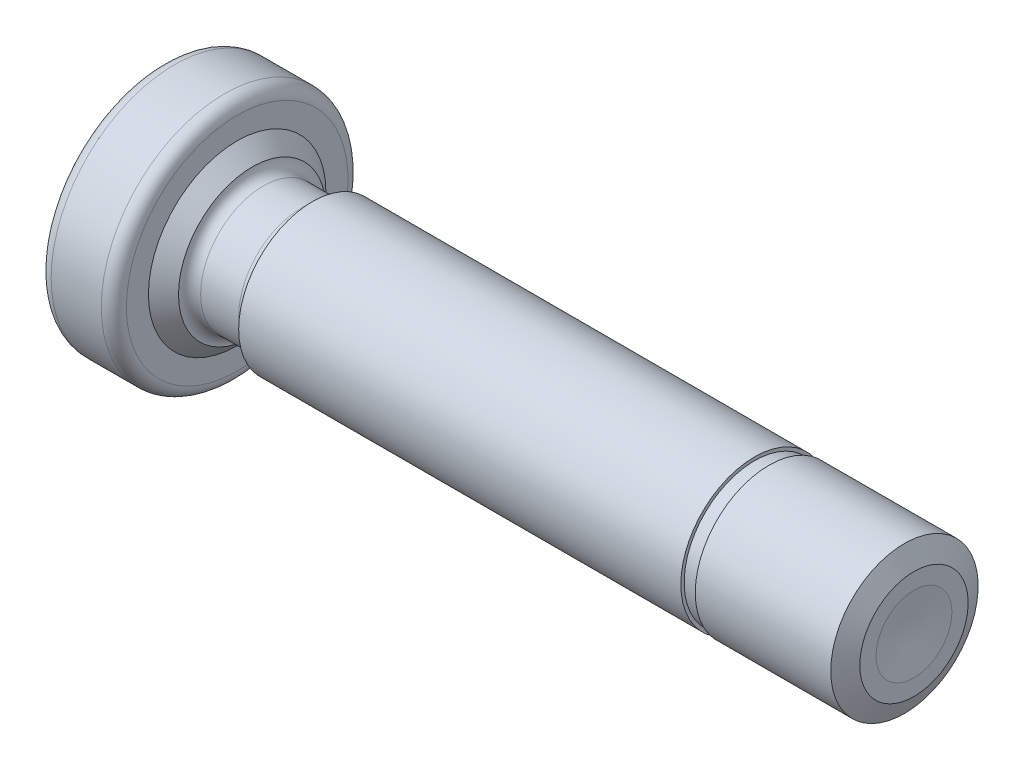
ISO-10303-21;
HEADER;
FILE_DESCRIPTION(('STEP AP214'),'2;1');
FILE_NAME('part.step','',(''),(''),'','','');
FILE_SCHEMA(('AUTOMOTIVE_DESIGN { 1 0 10303 214 1 1 1 1 }'));
ENDSEC;
DATA;
#1=APPLICATION_CONTEXT('core data for automotive mechanical design processes');
#2=APPLICATION_PROTOCOL_DEFINITION('international standard','automotive_design',2000,#1);
#3=PRODUCT_CONTEXT('',#1,'mechanical');
#4=PRODUCT('Part','Part','',(#3));
#5=PRODUCT_RELATED_PRODUCT_CATEGORY('part','',(#4));
#6=PRODUCT_DEFINITION_FORMATION('','',#4);
#7=PRODUCT_DEFINITION_CONTEXT('part definition',#1,'design');
#8=PRODUCT_DEFINITION('design','',#6,#7);
#9=PRODUCT_DEFINITION_SHAPE('','',#8);
#10=(LENGTH_UNIT() NAMED_UNIT(*) SI_UNIT(.MILLI.,.METRE.));
#11=(NAMED_UNIT(*) PLANE_ANGLE_UNIT() SI_UNIT($,.RADIAN.));
#12=(NAMED_UNIT(*) SI_UNIT($,.STERADIAN.) SOLID_ANGLE_UNIT());
#13=UNCERTAINTY_MEASURE_WITH_UNIT(LENGTH_MEASURE(1.E-05),#10,'distance_accuracy_value','');
#14=(GEOMETRIC_REPRESENTATION_CONTEXT(3) GLOBAL_UNCERTAINTY_ASSIGNED_CONTEXT((#13)) GLOBAL_UNIT_ASSIGNED_CONTEXT((#10,
#11,#12)) REPRESENTATION_CONTEXT('',''));
#15=CARTESIAN_POINT('',(0.,0.,0.));
#16=DIRECTION('',(0.,0.,1.));
#17=DIRECTION('',(1.,0.,0.));
#18=AXIS2_PLACEMENT_3D('',#15,#16,#17);
#19=CARTESIAN_POINT('',(-7.9375,0.,0.));
#20=DIRECTION('',(-1.,0.,0.));
#21=DIRECTION('',(0.,0.,1.));
#22=AXIS2_PLACEMENT_3D('',#19,#20,#21);
#23=CYLINDRICAL_SURFACE('',#22,1.55575);
#24=CARTESIAN_POINT('',(-4.7625,0.,0.));
#25=DIRECTION('',(-1.,0.,0.));
#26=DIRECTION('',(0.,0.,1.));
#27=AXIS2_PLACEMENT_3D('',#24,#25,#26);
#28=CIRCLE('',#27,1.55575);
#29=CARTESIAN_POINT('',(-4.7625,0.,1.55575));
#30=VERTEX_POINT('',#29);
#31=EDGE_CURVE('E82',#30,#30,#28,.T.);
#32=ORIENTED_EDGE('',*,*,#31,.F.);
#33=EDGE_LOOP('',(#32));
#34=FACE_BOUND('',#33,.T.);
#35=CARTESIAN_POINT('',(4.5715,0.,0.));
#36=DIRECTION('',(1.,0.,0.));
#37=DIRECTION('',(0.,0.,-1.));
#38=AXIS2_PLACEMENT_3D('',#35,#36,#37);
#39=CIRCLE('',#38,1.55575);
#40=CARTESIAN_POINT('',(4.5715,0.,-1.55575));
#41=VERTEX_POINT('',#40);
#42=EDGE_CURVE('E124',#41,#41,#39,.T.);
#43=ORIENTED_EDGE('',*,*,#42,.F.);
#44=EDGE_LOOP('',(#43));
#45=FACE_BOUND('',#44,.T.);
#46=ADVANCED_FACE('F17',(#34,#45),#23,.T.);
#47=CARTESIAN_POINT('',(-7.9375,0.,0.));
#48=DIRECTION('',(1.,0.,0.));
#49=DIRECTION('',(0.,0.,-1.));
#50=AXIS2_PLACEMENT_3D('',#47,#48,#49);
#51=PLANE('',#50);
#52=CARTESIAN_POINT('',(-7.9375,0.,0.));
#53=DIRECTION('',(1.,0.,0.));
#54=DIRECTION('',(0.,0.,-1.));
#55=AXIS2_PLACEMENT_3D('',#52,#53,#54);
#56=CIRCLE('',#55,2.33891666666666);
#57=CARTESIAN_POINT('',(-7.9375,0.,-2.33891666666666));
#58=VERTEX_POINT('',#57);
#59=EDGE_CURVE('E118',#58,#58,#56,.F.);
#60=ORIENTED_EDGE('',*,*,#59,.T.);
#61=EDGE_LOOP('',(#60));
#62=FACE_BOUND('',#61,.T.);
#63=ADVANCED_FACE('F55',(#62),#51,.F.);
#64=CARTESIAN_POINT('',(-7.9375,0.,0.));
#65=DIRECTION('',(-1.,0.,0.));
#66=DIRECTION('',(0.,0.,1.));
#67=AXIS2_PLACEMENT_3D('',#64,#65,#66);
#68=CYLINDRICAL_SURFACE('',#67,2.6035);
#69=CARTESIAN_POINT('',(-6.61458333333333,0.,0.));
#70=DIRECTION('',(-1.,0.,0.));
#71=DIRECTION('',(0.,0.,1.));
#72=AXIS2_PLACEMENT_3D('',#69,#70,#71);
#73=CIRCLE('',#72,2.6035);
#74=CARTESIAN_POINT('',(-6.61458333333333,0.,2.6035));
#75=VERTEX_POINT('',#74);
#76=EDGE_CURVE('E110',#75,#75,#73,.T.);
#77=ORIENTED_EDGE('',*,*,#76,.T.);
#78=EDGE_LOOP('',(#77));
#79=FACE_BOUND('',#78,.T.);
#80=CARTESIAN_POINT('',(-7.67291666666667,0.,0.));
#81=DIRECTION('',(1.,0.,0.));
#82=DIRECTION('',(0.,0.,-1.));
#83=AXIS2_PLACEMENT_3D('',#80,#81,#82);
#84=CIRCLE('',#83,2.6035);
#85=CARTESIAN_POINT('',(-7.67291666666667,0.,-2.6035));
#86=VERTEX_POINT('',#85);
#87=EDGE_CURVE('E106',#86,#86,#84,.T.);
#88=ORIENTED_EDGE('',*,*,#87,.T.);
#89=EDGE_LOOP('',(#88));
#90=FACE_BOUND('',#89,.T.);
#91=ADVANCED_FACE('F62',(#79,#90),#68,.T.);
#92=CARTESIAN_POINT('',(-6.35,2.6035,0.));
#93=DIRECTION('',(-1.,0.,0.));
#94=DIRECTION('',(0.,0.,1.));
#95=AXIS2_PLACEMENT_3D('',#92,#93,#94);
#96=PLANE('',#95);
#97=CARTESIAN_POINT('',(-6.35,0.,0.));
#98=DIRECTION('',(-1.,0.,0.));
#99=DIRECTION('',(0.,0.,1.));
#100=AXIS2_PLACEMENT_3D('',#97,#98,#99);
#101=CIRCLE('',#100,2.33891666666666);
#102=CARTESIAN_POINT('',(-6.35,0.,2.33891666666666));
#103=VERTEX_POINT('',#102);
#104=EDGE_CURVE('E114',#103,#103,#101,.F.);
#105=ORIENTED_EDGE('',*,*,#104,.T.);
#106=EDGE_LOOP('',(#105));
#107=FACE_BOUND('',#106,.T.);
#108=CARTESIAN_POINT('',(-6.35,0.,0.));
#109=DIRECTION('',(-1.,0.,0.));
#110=DIRECTION('',(0.,0.,1.));
#111=AXIS2_PLACEMENT_3D('',#108,#109,#110);
#112=CIRCLE('',#111,1.87325);
#113=CARTESIAN_POINT('',(-6.35,0.,1.87325));
#114=VERTEX_POINT('',#113);
#115=EDGE_CURVE('E102',#114,#114,#112,.T.);
#116=ORIENTED_EDGE('',*,*,#115,.T.);
#117=EDGE_LOOP('',(#116));
#118=FACE_BOUND('',#117,.T.);
#119=ADVANCED_FACE('F216',(#107,#118),#96,.F.);
#120=CARTESIAN_POINT('',(-6.0325,0.,0.));
#121=DIRECTION('',(-1.,0.,0.));
#122=DIRECTION('',(0.,0.,1.));
#123=AXIS2_PLACEMENT_3D('',#120,#121,#122);
#124=CONICAL_SURFACE('',#123,1.55575,0.785398163397449);
#125=ORIENTED_EDGE('',*,*,#115,.F.);
#126=EDGE_LOOP('',(#125));
#127=FACE_BOUND('',#126,.T.);
#128=CARTESIAN_POINT('',(-6.0325,0.,0.));
#129=DIRECTION('',(-1.,0.,0.));
#130=DIRECTION('',(0.,0.,1.));
#131=AXIS2_PLACEMENT_3D('',#128,#129,#130);
#132=CIRCLE('',#131,1.55575);
#133=CARTESIAN_POINT('',(-6.0325,0.,1.55575));
#134=VERTEX_POINT('',#133);
#135=EDGE_CURVE('E91',#134,#134,#132,.T.);
#136=ORIENTED_EDGE('',*,*,#135,.T.);
#137=EDGE_LOOP('',(#136));
#138=FACE_BOUND('',#137,.T.);
#139=ADVANCED_FACE('F228',(#127,#138),#124,.T.);
#140=CARTESIAN_POINT('',(-7.9375,0.,0.));
#141=DIRECTION('',(-1.,0.,0.));
#142=DIRECTION('',(0.,0.,1.));
#143=AXIS2_PLACEMENT_3D('',#140,#141,#142);
#144=CYLINDRICAL_SURFACE('',#143,1.3223875);
#145=CARTESIAN_POINT('',(-4.9958625,0.,0.));
#146=DIRECTION('',(1.,0.,0.));
#147=DIRECTION('',(0.,0.,-1.));
#148=AXIS2_PLACEMENT_3D('',#145,#146,#147);
#149=CIRCLE('',#148,1.3223875);
#150=CARTESIAN_POINT('',(-4.9958625,0.,-1.3223875));
#151=VERTEX_POINT('',#150);
#152=EDGE_CURVE('E11',#151,#151,#149,.F.);
#153=ORIENTED_EDGE('',*,*,#152,.T.);
#154=EDGE_LOOP('',(#153));
#155=FACE_BOUND('',#154,.T.);
#156=CARTESIAN_POINT('',(-5.7991375,0.,0.));
#157=DIRECTION('',(-1.,0.,0.));
#158=DIRECTION('',(0.,0.,1.));
#159=AXIS2_PLACEMENT_3D('',#156,#157,#158);
#160=CIRCLE('',#159,1.3223875);
#161=CARTESIAN_POINT('',(-5.7991375,0.,1.3223875));
#162=VERTEX_POINT('',#161);
#163=EDGE_CURVE('E26',#162,#162,#160,.F.);
#164=ORIENTED_EDGE('',*,*,#163,.T.);
#165=EDGE_LOOP('',(#164));
#166=FACE_BOUND('',#165,.T.);
#167=ADVANCED_FACE('F240',(#155,#166),#144,.T.);
#168=CARTESIAN_POINT('',(-6.61458333333333,0.,0.));
#169=DIRECTION('',(-1.,0.,0.));
#170=DIRECTION('',(0.,0.,1.));
#171=AXIS2_PLACEMENT_3D('',#168,#169,#170);
#172=TOROIDAL_SURFACE('',#171,2.33891666666666,0.264583333333334);
#173=ORIENTED_EDGE('',*,*,#104,.F.);
#174=EDGE_LOOP('',(#173));
#175=FACE_BOUND('',#174,.T.);
#176=ORIENTED_EDGE('',*,*,#76,.F.);
#177=EDGE_LOOP('',(#176));
#178=FACE_BOUND('',#177,.T.);
#179=ADVANCED_FACE('F252',(#175,#178),#172,.T.);
#180=CARTESIAN_POINT('',(-7.67291666666667,0.,0.));
#181=DIRECTION('',(1.,0.,0.));
#182=DIRECTION('',(0.,0.,-1.));
#183=AXIS2_PLACEMENT_3D('',#180,#181,#182);
#184=TOROIDAL_SURFACE('',#183,2.33891666666666,0.264583333333334);
#185=ORIENTED_EDGE('',*,*,#87,.F.);
#186=EDGE_LOOP('',(#185));
#187=FACE_BOUND('',#186,.T.);
#188=ORIENTED_EDGE('',*,*,#59,.F.);
#189=EDGE_LOOP('',(#188));
#190=FACE_BOUND('',#189,.T.);
#191=ADVANCED_FACE('F262',(#187,#190),#184,.T.);
#192=CARTESIAN_POINT('',(-4.9958625,0.,0.));
#193=DIRECTION('',(1.,0.,0.));
#194=DIRECTION('',(0.,0.,-1.));
#195=AXIS2_PLACEMENT_3D('',#192,#193,#194);
#196=TOROIDAL_SURFACE('',#195,1.55575,0.2333625);
#197=ORIENTED_EDGE('',*,*,#31,.T.);
#198=EDGE_LOOP('',(#197));
#199=FACE_BOUND('',#198,.T.);
#200=ORIENTED_EDGE('',*,*,#152,.F.);
#201=EDGE_LOOP('',(#200));
#202=FACE_BOUND('',#201,.T.);
#203=ADVANCED_FACE('F273',(#199,#202),#196,.F.);
#204=CARTESIAN_POINT('',(-5.7991375,0.,0.));
#205=DIRECTION('',(-1.,0.,0.));
#206=DIRECTION('',(0.,0.,1.));
#207=AXIS2_PLACEMENT_3D('',#204,#205,#206);
#208=TOROIDAL_SURFACE('',#207,1.55575,0.2333625);
#209=ORIENTED_EDGE('',*,*,#163,.F.);
#210=EDGE_LOOP('',(#209));
#211=FACE_BOUND('',#210,.T.);
#212=ORIENTED_EDGE('',*,*,#135,.F.);
#213=EDGE_LOOP('',(#212));
#214=FACE_BOUND('',#213,.T.);
#215=ADVANCED_FACE('F19',(#211,#214),#208,.F.);
#216=CARTESIAN_POINT('',(4.8763,0.,0.));
#217=DIRECTION('',(1.,0.,0.));
#218=DIRECTION('',(0.,1.,0.));
#219=AXIS2_PLACEMENT_3D('',#216,#217,#218);
#220=PLANE('',#219);
#221=CARTESIAN_POINT('',(4.8763,0.,0.));
#222=DIRECTION('',(1.,0.,0.));
#223=DIRECTION('',(0.,0.,-1.));
#224=AXIS2_PLACEMENT_3D('',#221,#222,#223);
#225=CIRCLE('',#224,1.4859);
#226=CARTESIAN_POINT('',(4.8763,0.,-1.4859));
#227=VERTEX_POINT('',#226);
#228=EDGE_CURVE('E127',#227,#227,#225,.T.);
#229=ORIENTED_EDGE('',*,*,#228,.T.);
#230=EDGE_LOOP('',(#229));
#231=FACE_BOUND('',#230,.T.);
#232=CARTESIAN_POINT('',(4.8763,0.,0.));
#233=DIRECTION('',(1.,0.,0.));
#234=DIRECTION('',(0.,0.,-1.));
#235=AXIS2_PLACEMENT_3D('',#232,#233,#234);
#236=CIRCLE('',#235,1.55575);
#237=CARTESIAN_POINT('',(4.8763,0.,-1.55575));
#238=VERTEX_POINT('',#237);
#239=EDGE_CURVE('E21',#238,#238,#236,.T.);
#240=ORIENTED_EDGE('',*,*,#239,.F.);
#241=EDGE_LOOP('',(#240));
#242=FACE_BOUND('',#241,.T.);
#243=ADVANCED_FACE('F295',(#231,#242),#220,.F.);
#244=CARTESIAN_POINT('',(4.5715,0.,0.));
#245=DIRECTION('',(1.,0.,0.));
#246=DIRECTION('',(0.,1.,0.));
#247=AXIS2_PLACEMENT_3D('',#244,#245,#246);
#248=PLANE('',#247);
#249=CARTESIAN_POINT('',(4.5715,0.,0.));
#250=DIRECTION('',(1.,0.,0.));
#251=DIRECTION('',(0.,0.,-1.));
#252=AXIS2_PLACEMENT_3D('',#249,#250,#251);
#253=CIRCLE('',#252,1.4859);
#254=CARTESIAN_POINT('',(4.5715,0.,-1.4859));
#255=VERTEX_POINT('',#254);
#256=EDGE_CURVE('E135',#255,#255,#253,.T.);
#257=ORIENTED_EDGE('',*,*,#256,.F.);
#258=EDGE_LOOP('',(#257));
#259=FACE_BOUND('',#258,.T.);
#260=ORIENTED_EDGE('',*,*,#42,.T.);
#261=EDGE_LOOP('',(#260));
#262=FACE_BOUND('',#261,.T.);
#263=ADVANCED_FACE('F50',(#259,#262),#248,.T.);
#264=CARTESIAN_POINT('',(4.8763,0.,0.));
#265=DIRECTION('',(-1.,0.,0.));
#266=DIRECTION('',(0.,0.,1.));
#267=AXIS2_PLACEMENT_3D('',#264,#265,#266);
#268=CYLINDRICAL_SURFACE('',#267,1.4859);
#269=ORIENTED_EDGE('',*,*,#228,.F.);
#270=EDGE_LOOP('',(#269));
#271=FACE_BOUND('',#270,.T.);
#272=ORIENTED_EDGE('',*,*,#256,.T.);
#273=EDGE_LOOP('',(#272));
#274=FACE_BOUND('',#273,.T.);
#275=ADVANCED_FACE('F39',(#271,#274),#268,.T.);
#276=CARTESIAN_POINT('',(7.83684418703472,0.,0.));
#277=DIRECTION('',(1.,0.,0.));
#278=DIRECTION('',(0.,0.,-1.));
#279=AXIS2_PLACEMENT_3D('',#276,#277,#278);
#280=CONICAL_SURFACE('',#279,0.,1.445649739904);
#281=CARTESIAN_POINT('',(7.9375,0.,0.));
#282=DIRECTION('',(-1.,0.,0.));
#283=DIRECTION('',(0.,0.,1.));
#284=AXIS2_PLACEMENT_3D('',#281,#282,#283);
#285=CIRCLE('',#284,0.8001);
#286=CARTESIAN_POINT('',(7.9375,0.,0.8001));
#287=VERTEX_POINT('',#286);
#288=EDGE_CURVE('E95',#287,#287,#285,.T.);
#289=ORIENTED_EDGE('',*,*,#288,.F.);
#290=EDGE_LOOP('',(#289));
#291=FACE_BOUND('',#290,.T.);
#292=CARTESIAN_POINT('',(7.83684418703472,0.,0.));
#293=VERTEX_POINT('',#292);
#294=VERTEX_LOOP('',#293);
#295=FACE_BOUND('',#294,.T.);
#296=ADVANCED_FACE('F36',(#291,#295),#280,.F.);
#297=CARTESIAN_POINT('',(7.9375,1.143,0.));
#298=DIRECTION('',(-1.,0.,0.));
#299=DIRECTION('',(0.,0.,1.));
#300=AXIS2_PLACEMENT_3D('',#297,#298,#299);
#301=PLANE('',#300);
#302=CARTESIAN_POINT('',(7.9375,0.,0.));
#303=DIRECTION('',(-1.,0.,0.));
#304=DIRECTION('',(0.,0.,1.));
#305=AXIS2_PLACEMENT_3D('',#302,#303,#304);
#306=CIRCLE('',#305,1.143);
#307=CARTESIAN_POINT('',(7.9375,0.,1.143));
#308=VERTEX_POINT('',#307);
#309=EDGE_CURVE('E83',#308,#308,#306,.T.);
#310=ORIENTED_EDGE('',*,*,#309,.F.);
#311=EDGE_LOOP('',(#310));
#312=FACE_BOUND('',#311,.T.);
#313=ORIENTED_EDGE('',*,*,#288,.T.);
#314=EDGE_LOOP('',(#313));
#315=FACE_BOUND('',#314,.T.);
#316=ADVANCED_FACE('F38',(#312,#315),#301,.F.);
#317=CARTESIAN_POINT('',(7.9375,0.,0.));
#318=DIRECTION('',(-1.,0.,0.));
#319=DIRECTION('',(0.,0.,1.));
#320=AXIS2_PLACEMENT_3D('',#317,#318,#319);
#321=CONICAL_SURFACE('',#320,1.143,1.11701072127637);
#322=CARTESIAN_POINT('',(7.73618837406944,0.,0.));
#323=DIRECTION('',(-1.,0.,0.));
#324=DIRECTION('',(0.,0.,1.));
#325=AXIS2_PLACEMENT_3D('',#322,#323,#324);
#326=CIRCLE('',#325,1.55575);
#327=CARTESIAN_POINT('',(7.73618837406944,0.,1.55575));
#328=VERTEX_POINT('',#327);
#329=EDGE_CURVE('E80',#328,#328,#326,.T.);
#330=ORIENTED_EDGE('',*,*,#329,.F.);
#331=EDGE_LOOP('',(#330));
#332=FACE_BOUND('',#331,.T.);
#333=ORIENTED_EDGE('',*,*,#309,.T.);
#334=EDGE_LOOP('',(#333));
#335=FACE_BOUND('',#334,.T.);
#336=ADVANCED_FACE('F47',(#332,#335),#321,.T.);
#337=ORIENTED_EDGE('',*,*,#239,.T.);
#338=EDGE_LOOP('',(#337));
#339=FACE_BOUND('',#338,.T.);
#340=ORIENTED_EDGE('',*,*,#329,.T.);
#341=EDGE_LOOP('',(#340));
#342=FACE_BOUND('',#341,.T.);
#343=ADVANCED_FACE('F58',(#339,#342),#23,.T.);
#344=CLOSED_SHELL('',(#46,#63,#91,#119,#139,#167,#179,#191,#203,#215,#243,#263,#275,#296,#316,
#336,#343));
#345=MANIFOLD_SOLID_BREP('B1',#344);
#346=ADVANCED_BREP_SHAPE_REPRESENTATION('',(#18,#345),#14);
#347=SHAPE_DEFINITION_REPRESENTATION(#9,#346);
ENDSEC;
END-ISO-10303-21;
